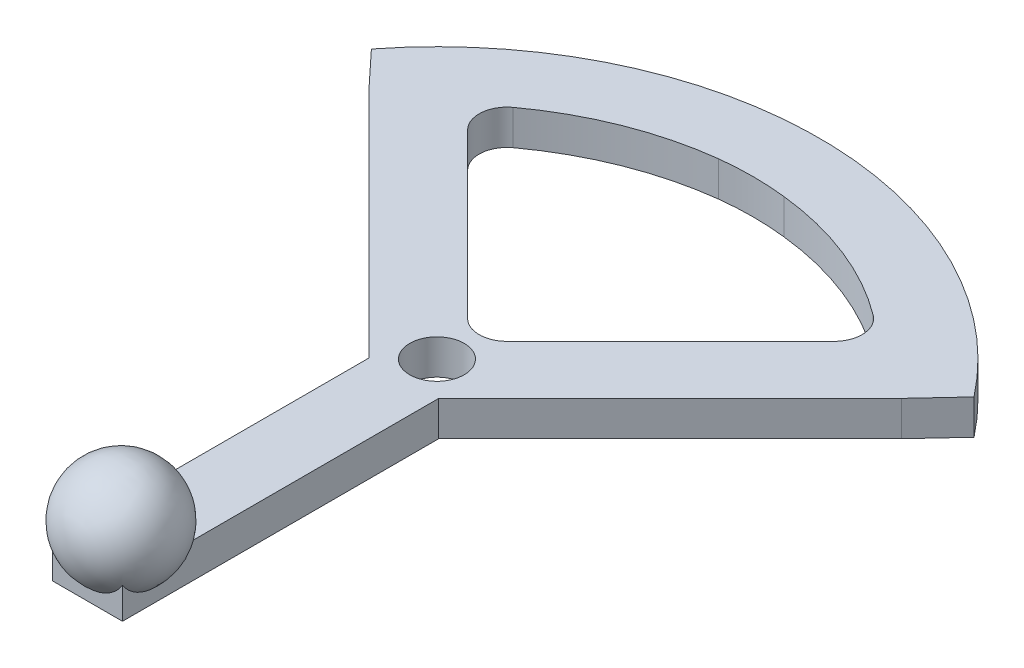
ISO-10303-21;
HEADER;
FILE_DESCRIPTION(('STEP AP214'),'2;1');
FILE_NAME('part.step','',(''),(''),'','','');
FILE_SCHEMA(('AUTOMOTIVE_DESIGN { 1 0 10303 214 1 1 1 1 }'));
ENDSEC;
DATA;
#1=APPLICATION_CONTEXT('core data for automotive mechanical design processes');
#2=APPLICATION_PROTOCOL_DEFINITION('international standard','automotive_design',2000,#1);
#3=PRODUCT_CONTEXT('',#1,'mechanical');
#4=PRODUCT('Part','Part','',(#3));
#5=PRODUCT_RELATED_PRODUCT_CATEGORY('part','',(#4));
#6=PRODUCT_DEFINITION_FORMATION('','',#4);
#7=PRODUCT_DEFINITION_CONTEXT('part definition',#1,'design');
#8=PRODUCT_DEFINITION('design','',#6,#7);
#9=PRODUCT_DEFINITION_SHAPE('','',#8);
#10=(LENGTH_UNIT() NAMED_UNIT(*) SI_UNIT(.MILLI.,.METRE.));
#11=(NAMED_UNIT(*) PLANE_ANGLE_UNIT() SI_UNIT($,.RADIAN.));
#12=(NAMED_UNIT(*) SI_UNIT($,.STERADIAN.) SOLID_ANGLE_UNIT());
#13=UNCERTAINTY_MEASURE_WITH_UNIT(LENGTH_MEASURE(1.E-05),#10,'distance_accuracy_value','');
#14=(GEOMETRIC_REPRESENTATION_CONTEXT(3) GLOBAL_UNCERTAINTY_ASSIGNED_CONTEXT((#13)) GLOBAL_UNIT_ASSIGNED_CONTEXT((#10,
#11,#12)) REPRESENTATION_CONTEXT('',''));
#15=CARTESIAN_POINT('',(0.,0.,0.));
#16=DIRECTION('',(0.,0.,1.));
#17=DIRECTION('',(1.,0.,0.));
#18=AXIS2_PLACEMENT_3D('',#15,#16,#17);
#19=CARTESIAN_POINT('',(-39.7785373265375,12.7,-45.3516658256481));
#20=DIRECTION('',(0.707106781186548,0.,-0.707106781186547));
#21=DIRECTION('',(-0.707106781186547,0.,-0.707106781186548));
#22=AXIS2_PLACEMENT_3D('',#19,#20,#21);
#23=PLANE('',#22);
#24=DIRECTION('',(0.707106781186547,0.,0.707106781186548));
#25=VECTOR('',#24,1.);
#26=CARTESIAN_POINT('',(-39.7785373265375,6.35,-45.3516658256481));
#27=LINE('',#26,#25);
#28=CARTESIAN_POINT('',(-33.2831311678834,6.35,-38.856259666994));
#29=VERTEX_POINT('',#28);
#30=CARTESIAN_POINT('',(-3.59210244842767,6.35,-9.16523094753825));
#31=VERTEX_POINT('',#30);
#32=EDGE_CURVE('E71',#29,#31,#27,.T.);
#33=ORIENTED_EDGE('',*,*,#32,.F.);
#34=DIRECTION('',(0.,-1.,0.));
#35=VECTOR('',#34,1.);
#36=CARTESIAN_POINT('',(-33.2831311678833,90.455148343755,-38.8562596669941));
#37=LINE('',#36,#35);
#38=CARTESIAN_POINT('',(-33.2831311678834,12.7,-38.856259666994));
#39=VERTEX_POINT('',#38);
#40=EDGE_CURVE('E66',#39,#29,#37,.T.);
#41=ORIENTED_EDGE('',*,*,#40,.F.);
#42=DIRECTION('',(0.707106781186547,0.,0.707106781186548));
#43=VECTOR('',#42,1.);
#44=CARTESIAN_POINT('',(-39.7785373265375,12.7,-45.3516658256481));
#45=LINE('',#44,#43);
#46=CARTESIAN_POINT('',(-3.59210244842767,12.7,-9.16523094753825));
#47=VERTEX_POINT('',#46);
#48=EDGE_CURVE('E271',#39,#47,#45,.T.);
#49=ORIENTED_EDGE('',*,*,#48,.T.);
#50=DIRECTION('',(0.,-1.,0.));
#51=VECTOR('',#50,1.);
#52=CARTESIAN_POINT('',(-3.59210244842766,0.,-9.16523094753824));
#53=LINE('',#52,#51);
#54=EDGE_CURVE('E684',#47,#31,#53,.T.);
#55=ORIENTED_EDGE('',*,*,#54,.T.);
#56=EDGE_LOOP('',(#33,#41,#49,#55));
#57=FACE_BOUND('',#56,.T.);
#58=ADVANCED_FACE('F51',(#57),#23,.T.);
#59=CARTESIAN_POINT('',(0.,12.7,0.));
#60=DIRECTION('',(0.,1.,0.));
#61=DIRECTION('',(0.,0.,1.));
#62=AXIS2_PLACEMENT_3D('',#59,#60,#61);
#63=PLANE('',#62);
#64=ORIENTED_EDGE('',*,*,#48,.F.);
#65=CARTESIAN_POINT('',(-29.6910287194557,12.7,-42.4483621154218));
#66=DIRECTION('',(0.,1.,0.));
#67=DIRECTION('',(0.,0.,1.));
#68=AXIS2_PLACEMENT_3D('',#65,#66,#67);
#69=CIRCLE('',#68,5.08);
#70=CARTESIAN_POINT('',(-32.692631835589,12.7,-46.5467494486565));
#71=VERTEX_POINT('',#70);
#72=EDGE_CURVE('E191',#71,#39,#69,.T.);
#73=ORIENTED_EDGE('',*,*,#72,.F.);
#74=CARTESIAN_POINT('',(0.887803026152101,12.7,-0.696041158092707));
#75=DIRECTION('',(0.,1.,0.));
#76=DIRECTION('',(0.,0.,1.));
#77=AXIS2_PLACEMENT_3D('',#74,#75,#76);
#78=CIRCLE('',#77,56.8325000000001);
#79=CARTESIAN_POINT('',(-5.94025595338294,12.7,-57.1168765544425));
#80=VERTEX_POINT('',#79);
#81=EDGE_CURVE('E178',#71,#80,#78,.F.);
#82=ORIENTED_EDGE('',*,*,#81,.T.);
#83=CARTESIAN_POINT('',(0.,12.7,-5.57312849911058));
#84=DIRECTION('',(0.,1.,0.));
#85=DIRECTION('',(0.,0.,1.));
#86=AXIS2_PLACEMENT_3D('',#83,#84,#85);
#87=CIRCLE('',#86,51.8849169256658);
#88=CARTESIAN_POINT('',(5.95896544452985,12.7,-57.1147169031764));
#89=VERTEX_POINT('',#88);
#90=EDGE_CURVE('E200',#80,#89,#87,.F.);
#91=ORIENTED_EDGE('',*,*,#90,.T.);
#92=CARTESIAN_POINT('',(0.,12.7,-2.81200490658602));
#93=DIRECTION('',(0.,1.,0.));
#94=DIRECTION('',(0.,0.,1.));
#95=AXIS2_PLACEMENT_3D('',#92,#93,#94);
#96=CIRCLE('',#95,54.6286902584507);
#97=CARTESIAN_POINT('',(32.7547865262767,12.7,-46.5317688466142));
#98=VERTEX_POINT('',#97);
#99=EDGE_CURVE('E195',#89,#98,#96,.F.);
#100=ORIENTED_EDGE('',*,*,#99,.T.);
#101=CARTESIAN_POINT('',(29.708872103539,12.7,-42.4662054995049));
#102=DIRECTION('',(0.,1.,0.));
#103=DIRECTION('',(0.,0.,1.));
#104=AXIS2_PLACEMENT_3D('',#101,#102,#103);
#105=CIRCLE('',#104,5.07999999999999);
#106=CARTESIAN_POINT('',(33.3009745519667,12.7,-38.8741030510773));
#107=VERTEX_POINT('',#106);
#108=EDGE_CURVE('E207',#107,#98,#105,.T.);
#109=ORIENTED_EDGE('',*,*,#108,.F.);
#110=DIRECTION('',(0.707106781186548,0.,-0.707106781186547));
#111=VECTOR('',#110,1.);
#112=CARTESIAN_POINT('',(0.,12.7,-5.57312849911058));
#113=LINE('',#112,#111);
#114=CARTESIAN_POINT('',(3.59210244842766,12.7,-9.16523094753824));
#115=VERTEX_POINT('',#114);
#116=EDGE_CURVE('E273',#115,#107,#113,.T.);
#117=ORIENTED_EDGE('',*,*,#116,.F.);
#118=CARTESIAN_POINT('',(0.,12.7,-12.7573333959659));
#119=DIRECTION('',(0.,1.,0.));
#120=DIRECTION('',(0.,0.,1.));
#121=AXIS2_PLACEMENT_3D('',#118,#119,#120);
#122=CIRCLE('',#121,5.08);
#123=EDGE_CURVE('E59',#115,#47,#122,.F.);
#124=ORIENTED_EDGE('',*,*,#123,.T.);
#125=EDGE_LOOP('',(#64,#73,#82,#91,#100,#109,#117,#124));
#126=FACE_BOUND('',#125,.T.);
#127=CARTESIAN_POINT('',(0.,12.7,0.));
#128=DIRECTION('',(0.,1.,0.));
#129=DIRECTION('',(0.,0.,1.));
#130=AXIS2_PLACEMENT_3D('',#127,#128,#129);
#131=CIRCLE('',#130,4.953);
#132=CARTESIAN_POINT('',(0.,12.7,4.953));
#133=VERTEX_POINT('',#132);
#134=EDGE_CURVE('E268',#133,#133,#131,.T.);
#135=ORIENTED_EDGE('',*,*,#134,.F.);
#136=EDGE_LOOP('',(#135));
#137=FACE_BOUND('',#136,.T.);
#138=DIRECTION('',(0.681998360062498,0.,-0.731353701619171));
#139=VECTOR('',#138,1.);
#140=CARTESIAN_POINT('',(49.4171515154173,12.7,-37.1184070236845));
#141=LINE('',#140,#139);
#142=CARTESIAN_POINT('',(48.391694320571,12.7,-36.0187388144617));
#143=VERTEX_POINT('',#142);
#144=CARTESIAN_POINT('',(54.7608316819994,12.7,-42.8488024307067));
#145=VERTEX_POINT('',#144);
#146=EDGE_CURVE('E290',#143,#145,#141,.T.);
#147=ORIENTED_EDGE('',*,*,#146,.T.);
#148=CARTESIAN_POINT('',(0.,12.7,0.));
#149=DIRECTION('',(0.,1.,0.));
#150=DIRECTION('',(0.,0.,1.));
#151=AXIS2_PLACEMENT_3D('',#148,#149,#150);
#152=CIRCLE('',#151,69.5325);
#153=CARTESIAN_POINT('',(-54.7608316819994,12.7,-42.8488024307067));
#154=VERTEX_POINT('',#153);
#155=EDGE_CURVE('E225',#145,#154,#152,.T.);
#156=ORIENTED_EDGE('',*,*,#155,.T.);
#157=DIRECTION('',(0.681998360062498,0.,0.731353701619171));
#158=VECTOR('',#157,1.);
#159=CARTESIAN_POINT('',(-56.4189854668726,12.7,-44.6269546660137));
#160=LINE('',#159,#158);
#161=CARTESIAN_POINT('',(-48.391694320571,12.7,-36.0187388144618));
#162=VERTEX_POINT('',#161);
#163=EDGE_CURVE('E291',#154,#162,#160,.T.);
#164=ORIENTED_EDGE('',*,*,#163,.T.);
#165=DIRECTION('',(-0.707106781186547,0.,-0.707106781186548));
#166=VECTOR('',#165,1.);
#167=CARTESIAN_POINT('',(-48.391694320571,12.7,-36.0187388144618));
#168=LINE('',#167,#166);
#169=CARTESIAN_POINT('',(-6.34999999999972,12.7,6.02295550610956));
#170=VERTEX_POINT('',#169);
#171=EDGE_CURVE('E278',#170,#162,#168,.T.);
#172=ORIENTED_EDGE('',*,*,#171,.F.);
#173=DIRECTION('',(0.,0.,-1.));
#174=VECTOR('',#173,1.);
#175=CARTESIAN_POINT('',(-6.34999999999971,12.7,4.87647737193525));
#176=LINE('',#175,#174);
#177=CARTESIAN_POINT('',(-6.34999999999971,12.7,50.9544231423557));
#178=VERTEX_POINT('',#177);
#179=EDGE_CURVE('E284',#178,#170,#176,.T.);
#180=ORIENTED_EDGE('',*,*,#179,.F.);
#181=CARTESIAN_POINT('',(0.,12.7,57.4301779246189));
#182=DIRECTION('',(0.,1.,0.));
#183=DIRECTION('',(0.,0.,1.));
#184=AXIS2_PLACEMENT_3D('',#181,#182,#183);
#185=CIRCLE('',#184,9.06961410424942);
#186=CARTESIAN_POINT('',(6.35000000000029,12.7,50.9544231423563));
#187=VERTEX_POINT('',#186);
#188=EDGE_CURVE('E235',#187,#178,#185,.T.);
#189=ORIENTED_EDGE('',*,*,#188,.F.);
#190=DIRECTION('',(0.,0.,1.));
#191=VECTOR('',#190,1.);
#192=CARTESIAN_POINT('',(6.35000000000029,12.7,4.87647737193525));
#193=LINE('',#192,#191);
#194=CARTESIAN_POINT('',(6.35000000000029,12.7,6.022955506109));
#195=VERTEX_POINT('',#194);
#196=EDGE_CURVE('E287',#195,#187,#193,.T.);
#197=ORIENTED_EDGE('',*,*,#196,.F.);
#198=DIRECTION('',(-0.707106781186548,0.,0.707106781186547));
#199=VECTOR('',#198,1.);
#200=CARTESIAN_POINT('',(0.,12.7,12.3729555061093));
#201=LINE('',#200,#199);
#202=EDGE_CURVE('E275',#143,#195,#201,.T.);
#203=ORIENTED_EDGE('',*,*,#202,.F.);
#204=EDGE_LOOP('',(#147,#156,#164,#172,#180,#189,#197,#203));
#205=FACE_BOUND('',#204,.T.);
#206=ADVANCED_FACE('F692',(#126,#137,#205),#63,.T.);
#207=CARTESIAN_POINT('',(48.391694320571,0.,-36.0187388144617));
#208=DIRECTION('',(0.731353701619171,0.,0.681998360062498));
#209=DIRECTION('',(0.681998360062498,0.,-0.731353701619171));
#210=AXIS2_PLACEMENT_3D('',#207,#208,#209);
#211=PLANE('',#210);
#212=DIRECTION('',(-0.681998360062498,0.,0.731353701619171));
#213=VECTOR('',#212,1.);
#214=CARTESIAN_POINT('',(48.391694320571,6.35,-36.0187388144617));
#215=LINE('',#214,#213);
#216=CARTESIAN_POINT('',(54.7608316819994,6.35,-42.8488024307067));
#217=VERTEX_POINT('',#216);
#218=CARTESIAN_POINT('',(48.391694320571,6.35,-36.0187388144617));
#219=VERTEX_POINT('',#218);
#220=EDGE_CURVE('E251',#217,#219,#215,.T.);
#221=ORIENTED_EDGE('',*,*,#220,.F.);
#222=DIRECTION('',(0.,-1.,0.));
#223=VECTOR('',#222,1.);
#224=CARTESIAN_POINT('',(54.7608316819994,25.654,-42.8488024307067));
#225=LINE('',#224,#223);
#226=EDGE_CURVE('E223',#145,#217,#225,.T.);
#227=ORIENTED_EDGE('',*,*,#226,.F.);
#228=ORIENTED_EDGE('',*,*,#146,.F.);
#229=DIRECTION('',(0.,1.,0.));
#230=VECTOR('',#229,1.);
#231=CARTESIAN_POINT('',(48.391694320571,0.,-36.0187388144617));
#232=LINE('',#231,#230);
#233=EDGE_CURVE('E295',#219,#143,#232,.T.);
#234=ORIENTED_EDGE('',*,*,#233,.F.);
#235=EDGE_LOOP('',(#221,#227,#228,#234));
#236=FACE_BOUND('',#235,.T.);
#237=ADVANCED_FACE('F702',(#236),#211,.T.);
#238=CARTESIAN_POINT('',(-57.1706898676213,0.,-45.4330589445645));
#239=DIRECTION('',(-0.731353701619171,0.,0.681998360062498));
#240=DIRECTION('',(0.681998360062498,0.,0.731353701619171));
#241=AXIS2_PLACEMENT_3D('',#238,#239,#240);
#242=PLANE('',#241);
#243=ORIENTED_EDGE('',*,*,#163,.F.);
#244=DIRECTION('',(0.,-1.,0.));
#245=VECTOR('',#244,1.);
#246=CARTESIAN_POINT('',(-54.7608316819994,25.654,-42.8488024307067));
#247=LINE('',#246,#245);
#248=CARTESIAN_POINT('',(-54.7608316819994,6.35,-42.8488024307067));
#249=VERTEX_POINT('',#248);
#250=EDGE_CURVE('E222',#154,#249,#247,.T.);
#251=ORIENTED_EDGE('',*,*,#250,.T.);
#252=DIRECTION('',(-0.681998360062498,0.,-0.731353701619171));
#253=VECTOR('',#252,1.);
#254=CARTESIAN_POINT('',(-57.1706898676213,6.35,-45.4330589445645));
#255=LINE('',#254,#253);
#256=CARTESIAN_POINT('',(-48.391694320571,6.35,-36.0187388144618));
#257=VERTEX_POINT('',#256);
#258=EDGE_CURVE('E265',#257,#249,#255,.T.);
#259=ORIENTED_EDGE('',*,*,#258,.F.);
#260=DIRECTION('',(0.,1.,0.));
#261=VECTOR('',#260,1.);
#262=CARTESIAN_POINT('',(-48.391694320571,0.,-36.0187388144618));
#263=LINE('',#262,#261);
#264=EDGE_CURVE('E406',#257,#162,#263,.T.);
#265=ORIENTED_EDGE('',*,*,#264,.T.);
#266=EDGE_LOOP('',(#243,#251,#259,#265));
#267=FACE_BOUND('',#266,.T.);
#268=ADVANCED_FACE('F722',(#267),#242,.T.);
#269=CARTESIAN_POINT('',(0.,6.35,0.));
#270=DIRECTION('',(0.,1.,0.));
#271=DIRECTION('',(0.,0.,1.));
#272=AXIS2_PLACEMENT_3D('',#269,#270,#271);
#273=PLANE('',#272);
#274=CARTESIAN_POINT('',(-29.6910287194557,6.35,-42.4483621154218));
#275=DIRECTION('',(0.,1.,0.));
#276=DIRECTION('',(0.,0.,1.));
#277=AXIS2_PLACEMENT_3D('',#274,#275,#276);
#278=CIRCLE('',#277,5.08);
#279=CARTESIAN_POINT('',(-32.692631835589,6.35,-46.5467494486565));
#280=VERTEX_POINT('',#279);
#281=EDGE_CURVE('E188',#280,#29,#278,.T.);
#282=ORIENTED_EDGE('',*,*,#281,.T.);
#283=ORIENTED_EDGE('',*,*,#32,.T.);
#284=CARTESIAN_POINT('',(0.,6.35,-12.7573333959659));
#285=DIRECTION('',(0.,1.,0.));
#286=DIRECTION('',(0.,0.,1.));
#287=AXIS2_PLACEMENT_3D('',#284,#285,#286);
#288=CIRCLE('',#287,5.08);
#289=CARTESIAN_POINT('',(3.59210244842766,6.35,-9.16523094753823));
#290=VERTEX_POINT('',#289);
#291=EDGE_CURVE('E239',#290,#31,#288,.F.);
#292=ORIENTED_EDGE('',*,*,#291,.F.);
#293=DIRECTION('',(0.707106781186548,0.,-0.707106781186547));
#294=VECTOR('',#293,1.);
#295=CARTESIAN_POINT('',(0.,6.35,-5.57312849911058));
#296=LINE('',#295,#294);
#297=CARTESIAN_POINT('',(33.3009745519667,6.35,-38.8741030510773));
#298=VERTEX_POINT('',#297);
#299=EDGE_CURVE('E242',#290,#298,#296,.T.);
#300=ORIENTED_EDGE('',*,*,#299,.T.);
#301=CARTESIAN_POINT('',(29.708872103539,6.35,-42.4662054995049));
#302=DIRECTION('',(0.,1.,0.));
#303=DIRECTION('',(0.,0.,1.));
#304=AXIS2_PLACEMENT_3D('',#301,#302,#303);
#305=CIRCLE('',#304,5.07999999999999);
#306=CARTESIAN_POINT('',(32.7547865262767,6.35,-46.5317688466142));
#307=VERTEX_POINT('',#306);
#308=EDGE_CURVE('E194',#298,#307,#305,.T.);
#309=ORIENTED_EDGE('',*,*,#308,.T.);
#310=CARTESIAN_POINT('',(0.,6.35,-2.81200490658602));
#311=DIRECTION('',(0.,-1.,0.));
#312=DIRECTION('',(0.,0.,-1.));
#313=AXIS2_PLACEMENT_3D('',#310,#311,#312);
#314=CIRCLE('',#313,54.6286902584507);
#315=CARTESIAN_POINT('',(5.95896544452985,6.35,-57.1147169031765));
#316=VERTEX_POINT('',#315);
#317=EDGE_CURVE('E213',#316,#307,#314,.T.);
#318=ORIENTED_EDGE('',*,*,#317,.F.);
#319=CARTESIAN_POINT('',(0.,6.35,-5.57312849911058));
#320=DIRECTION('',(0.,-1.,0.));
#321=DIRECTION('',(0.,0.,-1.));
#322=AXIS2_PLACEMENT_3D('',#319,#320,#321);
#323=CIRCLE('',#322,51.8849169256658);
#324=CARTESIAN_POINT('',(-5.94025595338294,6.35,-57.1168765544425));
#325=VERTEX_POINT('',#324);
#326=EDGE_CURVE('E182',#325,#316,#323,.T.);
#327=ORIENTED_EDGE('',*,*,#326,.F.);
#328=CARTESIAN_POINT('',(0.887803026152101,6.35,-0.696041158092707));
#329=DIRECTION('',(0.,-1.,0.));
#330=DIRECTION('',(0.,0.,-1.));
#331=AXIS2_PLACEMENT_3D('',#328,#329,#330);
#332=CIRCLE('',#331,56.8325000000001);
#333=EDGE_CURVE('E176',#280,#325,#332,.T.);
#334=ORIENTED_EDGE('',*,*,#333,.F.);
#335=EDGE_LOOP('',(#282,#283,#292,#300,#309,#318,#327,#334));
#336=FACE_BOUND('',#335,.T.);
#337=CARTESIAN_POINT('',(0.,6.35,0.));
#338=DIRECTION('',(0.,1.,0.));
#339=DIRECTION('',(0.,0.,1.));
#340=AXIS2_PLACEMENT_3D('',#337,#338,#339);
#341=CIRCLE('',#340,4.953);
#342=CARTESIAN_POINT('',(0.,6.35,4.953));
#343=VERTEX_POINT('',#342);
#344=EDGE_CURVE('E245',#343,#343,#341,.F.);
#345=ORIENTED_EDGE('',*,*,#344,.F.);
#346=EDGE_LOOP('',(#345));
#347=FACE_BOUND('',#346,.T.);
#348=CARTESIAN_POINT('',(0.,6.35,57.4301779246189));
#349=VERTEX_POINT('',#348);
#350=VERTEX_LOOP('',#349);
#351=FACE_BOUND('',#350,.T.);
#352=CARTESIAN_POINT('',(0.,6.35,0.));
#353=DIRECTION('',(0.,-1.,0.));
#354=DIRECTION('',(0.,0.,-1.));
#355=AXIS2_PLACEMENT_3D('',#352,#353,#354);
#356=CIRCLE('',#355,69.5325);
#357=EDGE_CURVE('E219',#249,#217,#356,.T.);
#358=ORIENTED_EDGE('',*,*,#357,.T.);
#359=ORIENTED_EDGE('',*,*,#220,.T.);
#360=DIRECTION('',(-0.707106781186548,0.,0.707106781186547));
#361=VECTOR('',#360,1.);
#362=CARTESIAN_POINT('',(0.,6.35,12.3729555061093));
#363=LINE('',#362,#361);
#364=CARTESIAN_POINT('',(6.35000000000029,6.35,6.022955506109));
#365=VERTEX_POINT('',#364);
#366=EDGE_CURVE('E248',#219,#365,#363,.T.);
#367=ORIENTED_EDGE('',*,*,#366,.T.);
#368=DIRECTION('',(0.,0.,-1.));
#369=VECTOR('',#368,1.);
#370=CARTESIAN_POINT('',(6.35000000000029,6.35,4.87647737193525));
#371=LINE('',#370,#369);
#372=CARTESIAN_POINT('',(6.35000000000029,6.35,63.5));
#373=VERTEX_POINT('',#372);
#374=EDGE_CURVE('E253',#373,#365,#371,.T.);
#375=ORIENTED_EDGE('',*,*,#374,.F.);
#376=DIRECTION('',(-1.,0.,0.));
#377=VECTOR('',#376,1.);
#378=CARTESIAN_POINT('',(6.35000000000029,6.35,63.5));
#379=LINE('',#378,#377);
#380=CARTESIAN_POINT('',(-6.34999999999972,6.35,63.5));
#381=VERTEX_POINT('',#380);
#382=EDGE_CURVE('E256',#373,#381,#379,.T.);
#383=ORIENTED_EDGE('',*,*,#382,.T.);
#384=DIRECTION('',(0.,0.,1.));
#385=VECTOR('',#384,1.);
#386=CARTESIAN_POINT('',(-6.34999999999971,6.35,4.87647737193525));
#387=LINE('',#386,#385);
#388=CARTESIAN_POINT('',(-6.34999999999971,6.35,6.02295550610957));
#389=VERTEX_POINT('',#388);
#390=EDGE_CURVE('E259',#389,#381,#387,.T.);
#391=ORIENTED_EDGE('',*,*,#390,.F.);
#392=DIRECTION('',(-0.707106781186547,0.,-0.707106781186548));
#393=VECTOR('',#392,1.);
#394=CARTESIAN_POINT('',(-48.391694320571,6.35,-36.0187388144618));
#395=LINE('',#394,#393);
#396=EDGE_CURVE('E262',#389,#257,#395,.T.);
#397=ORIENTED_EDGE('',*,*,#396,.T.);
#398=ORIENTED_EDGE('',*,*,#258,.T.);
#399=EDGE_LOOP('',(#358,#359,#367,#375,#383,#391,#397,#398));
#400=FACE_BOUND('',#399,.T.);
#401=ADVANCED_FACE('F186',(#336,#347,#351,#400),#273,.F.);
#402=CARTESIAN_POINT('',(0.,16.002,57.4301779246189));
#403=DIRECTION('',(0.,0.,-1.));
#404=DIRECTION('',(-1.,0.,0.));
#405=AXIS2_PLACEMENT_3D('',#402,#403,#404);
#406=SPHERICAL_SURFACE('',#405,9.652);
#407=CARTESIAN_POINT('',(6.35000000000029,16.002,57.4301779246189));
#408=DIRECTION('',(-1.,0.,0.));
#409=DIRECTION('',(0.,0.,1.));
#410=AXIS2_PLACEMENT_3D('',#407,#408,#409);
#411=CIRCLE('',#410,7.26901671479687);
#412=CARTESIAN_POINT('',(6.35000000000029,12.0025170367644,63.5));
#413=VERTEX_POINT('',#412);
#414=EDGE_CURVE('E232',#187,#413,#411,.T.);
#415=ORIENTED_EDGE('',*,*,#414,.F.);
#416=ORIENTED_EDGE('',*,*,#188,.T.);
#417=CARTESIAN_POINT('',(-6.3499999999997,16.002,57.4301779246189));
#418=DIRECTION('',(1.,0.,0.));
#419=DIRECTION('',(0.,0.,-1.));
#420=AXIS2_PLACEMENT_3D('',#417,#418,#419);
#421=CIRCLE('',#420,7.26901671479738);
#422=CARTESIAN_POINT('',(-6.34999999999972,12.0025170367635,63.5));
#423=VERTEX_POINT('',#422);
#424=EDGE_CURVE('E230',#423,#178,#421,.T.);
#425=ORIENTED_EDGE('',*,*,#424,.F.);
#426=CARTESIAN_POINT('',(0.,16.002,63.5));
#427=DIRECTION('',(0.,0.,1.));
#428=DIRECTION('',(1.,0.,0.));
#429=AXIS2_PLACEMENT_3D('',#426,#427,#428);
#430=CIRCLE('',#429,7.50455621427515);
#431=EDGE_CURVE('E14',#423,#413,#430,.T.);
#432=ORIENTED_EDGE('',*,*,#431,.T.);
#433=EDGE_LOOP('',(#415,#416,#425,#432));
#434=FACE_BOUND('',#433,.T.);
#435=ADVANCED_FACE('F719',(#434),#406,.T.);
#436=CARTESIAN_POINT('',(6.35000000000029,0.,4.87647737193525));
#437=DIRECTION('',(-1.,0.,0.));
#438=DIRECTION('',(0.,0.,1.));
#439=AXIS2_PLACEMENT_3D('',#436,#437,#438);
#440=PLANE('',#439);
#441=ORIENTED_EDGE('',*,*,#196,.T.);
#442=ORIENTED_EDGE('',*,*,#414,.T.);
#443=DIRECTION('',(0.,-1.,0.));
#444=VECTOR('',#443,1.);
#445=CARTESIAN_POINT('',(6.35000000000029,12.7,63.5));
#446=LINE('',#445,#444);
#447=EDGE_CURVE('E281',#413,#373,#446,.T.);
#448=ORIENTED_EDGE('',*,*,#447,.T.);
#449=ORIENTED_EDGE('',*,*,#374,.T.);
#450=DIRECTION('',(0.,1.,0.));
#451=VECTOR('',#450,1.);
#452=CARTESIAN_POINT('',(6.35000000000029,0.,6.022955506109));
#453=LINE('',#452,#451);
#454=EDGE_CURVE('E682',#365,#195,#453,.T.);
#455=ORIENTED_EDGE('',*,*,#454,.T.);
#456=EDGE_LOOP('',(#441,#442,#448,#449,#455));
#457=FACE_BOUND('',#456,.T.);
#458=ADVANCED_FACE('F716',(#457),#440,.F.);
#459=CARTESIAN_POINT('',(-6.34999999999971,0.,4.87647737193525));
#460=DIRECTION('',(1.,0.,0.));
#461=DIRECTION('',(0.,0.,-1.));
#462=AXIS2_PLACEMENT_3D('',#459,#460,#461);
#463=PLANE('',#462);
#464=DIRECTION('',(0.,-1.,0.));
#465=VECTOR('',#464,1.);
#466=CARTESIAN_POINT('',(-6.34999999999972,12.7,63.5));
#467=LINE('',#466,#465);
#468=EDGE_CURVE('E282',#423,#381,#467,.T.);
#469=ORIENTED_EDGE('',*,*,#468,.F.);
#470=ORIENTED_EDGE('',*,*,#424,.T.);
#471=ORIENTED_EDGE('',*,*,#179,.T.);
#472=DIRECTION('',(0.,-1.,0.));
#473=VECTOR('',#472,1.);
#474=CARTESIAN_POINT('',(-6.34999999999971,0.,6.02295550610957));
#475=LINE('',#474,#473);
#476=EDGE_CURVE('E677',#170,#389,#475,.T.);
#477=ORIENTED_EDGE('',*,*,#476,.T.);
#478=ORIENTED_EDGE('',*,*,#390,.T.);
#479=EDGE_LOOP('',(#469,#470,#471,#477,#478));
#480=FACE_BOUND('',#479,.T.);
#481=ADVANCED_FACE('F712',(#480),#463,.F.);
#482=CARTESIAN_POINT('',(6.35000000000029,12.7,63.5));
#483=DIRECTION('',(0.,0.,1.));
#484=DIRECTION('',(1.,0.,0.));
#485=AXIS2_PLACEMENT_3D('',#482,#483,#484);
#486=PLANE('',#485);
#487=ORIENTED_EDGE('',*,*,#431,.F.);
#488=ORIENTED_EDGE('',*,*,#468,.T.);
#489=ORIENTED_EDGE('',*,*,#382,.F.);
#490=ORIENTED_EDGE('',*,*,#447,.F.);
#491=EDGE_LOOP('',(#487,#488,#489,#490));
#492=FACE_BOUND('',#491,.T.);
#493=ADVANCED_FACE('F708',(#492),#486,.T.);
#494=CARTESIAN_POINT('',(-48.391694320571,12.7,-36.0187388144618));
#495=DIRECTION('',(-0.707106781186548,0.,0.707106781186547));
#496=DIRECTION('',(0.707106781186547,0.,0.707106781186548));
#497=AXIS2_PLACEMENT_3D('',#494,#495,#496);
#498=PLANE('',#497);
#499=ORIENTED_EDGE('',*,*,#396,.F.);
#500=ORIENTED_EDGE('',*,*,#476,.F.);
#501=ORIENTED_EDGE('',*,*,#171,.T.);
#502=ORIENTED_EDGE('',*,*,#264,.F.);
#503=EDGE_LOOP('',(#499,#500,#501,#502));
#504=FACE_BOUND('',#503,.T.);
#505=ADVANCED_FACE('F711',(#504),#498,.T.);
#506=CARTESIAN_POINT('',(0.,12.7,12.3729555061093));
#507=DIRECTION('',(0.707106781186547,0.,0.707106781186548));
#508=DIRECTION('',(0.707106781186548,0.,-0.707106781186547));
#509=AXIS2_PLACEMENT_3D('',#506,#507,#508);
#510=PLANE('',#509);
#511=ORIENTED_EDGE('',*,*,#366,.F.);
#512=ORIENTED_EDGE('',*,*,#233,.T.);
#513=ORIENTED_EDGE('',*,*,#202,.T.);
#514=ORIENTED_EDGE('',*,*,#454,.F.);
#515=EDGE_LOOP('',(#511,#512,#513,#514));
#516=FACE_BOUND('',#515,.T.);
#517=ADVANCED_FACE('F738',(#516),#510,.T.);
#518=CARTESIAN_POINT('',(0.,12.7,-5.57312849911058));
#519=DIRECTION('',(-0.707106781186547,0.,-0.707106781186548));
#520=DIRECTION('',(-0.707106781186548,0.,0.707106781186547));
#521=AXIS2_PLACEMENT_3D('',#518,#519,#520);
#522=PLANE('',#521);
#523=DIRECTION('',(0.,-1.,0.));
#524=VECTOR('',#523,1.);
#525=CARTESIAN_POINT('',(33.3009745519667,90.455148343755,-38.8741030510773));
#526=LINE('',#525,#524);
#527=EDGE_CURVE('E198',#107,#298,#526,.T.);
#528=ORIENTED_EDGE('',*,*,#527,.T.);
#529=ORIENTED_EDGE('',*,*,#299,.F.);
#530=DIRECTION('',(0.,-1.,0.));
#531=VECTOR('',#530,1.);
#532=CARTESIAN_POINT('',(3.59210244842766,12.7,-9.16523094753824));
#533=LINE('',#532,#531);
#534=EDGE_CURVE('E686',#290,#115,#533,.F.);
#535=ORIENTED_EDGE('',*,*,#534,.T.);
#536=ORIENTED_EDGE('',*,*,#116,.T.);
#537=EDGE_LOOP('',(#528,#529,#535,#536));
#538=FACE_BOUND('',#537,.T.);
#539=ADVANCED_FACE('F706',(#538),#522,.T.);
#540=CARTESIAN_POINT('',(0.,0.,0.));
#541=DIRECTION('',(0.,1.,0.));
#542=DIRECTION('',(0.,0.,1.));
#543=AXIS2_PLACEMENT_3D('',#540,#541,#542);
#544=CYLINDRICAL_SURFACE('',#543,4.953);
#545=ORIENTED_EDGE('',*,*,#344,.T.);
#546=EDGE_LOOP('',(#545));
#547=FACE_BOUND('',#546,.T.);
#548=ORIENTED_EDGE('',*,*,#134,.T.);
#549=EDGE_LOOP('',(#548));
#550=FACE_BOUND('',#549,.T.);
#551=ADVANCED_FACE('F764',(#547,#550),#544,.F.);
#552=CARTESIAN_POINT('',(0.,12.7,-12.7573333959659));
#553=DIRECTION('',(0.,1.,0.));
#554=DIRECTION('',(0.,0.,1.));
#555=AXIS2_PLACEMENT_3D('',#552,#553,#554);
#556=CYLINDRICAL_SURFACE('',#555,5.08);
#557=ORIENTED_EDGE('',*,*,#534,.F.);
#558=ORIENTED_EDGE('',*,*,#291,.T.);
#559=ORIENTED_EDGE('',*,*,#54,.F.);
#560=ORIENTED_EDGE('',*,*,#123,.F.);
#561=EDGE_LOOP('',(#557,#558,#559,#560));
#562=FACE_BOUND('',#561,.T.);
#563=ADVANCED_FACE('F53',(#562),#556,.F.);
#564=CARTESIAN_POINT('',(0.,25.654,0.));
#565=DIRECTION('',(0.,-1.,0.));
#566=DIRECTION('',(0.,0.,-1.));
#567=AXIS2_PLACEMENT_3D('',#564,#565,#566);
#568=CYLINDRICAL_SURFACE('',#567,69.5325);
#569=ORIENTED_EDGE('',*,*,#226,.T.);
#570=ORIENTED_EDGE('',*,*,#357,.F.);
#571=ORIENTED_EDGE('',*,*,#250,.F.);
#572=ORIENTED_EDGE('',*,*,#155,.F.);
#573=EDGE_LOOP('',(#569,#570,#571,#572));
#574=FACE_BOUND('',#573,.T.);
#575=ADVANCED_FACE('F753',(#574),#568,.T.);
#576=CARTESIAN_POINT('',(29.708872103539,90.455148343755,-42.4662054995049));
#577=DIRECTION('',(0.,-1.,0.));
#578=DIRECTION('',(0.,0.,-1.));
#579=AXIS2_PLACEMENT_3D('',#576,#577,#578);
#580=CYLINDRICAL_SURFACE('',#579,5.07999999999999);
#581=ORIENTED_EDGE('',*,*,#527,.F.);
#582=ORIENTED_EDGE('',*,*,#108,.T.);
#583=DIRECTION('',(0.,-1.,0.));
#584=VECTOR('',#583,1.);
#585=CARTESIAN_POINT('',(32.7547865262767,90.455148343755,-46.5317688466142));
#586=LINE('',#585,#584);
#587=EDGE_CURVE('E209',#98,#307,#586,.T.);
#588=ORIENTED_EDGE('',*,*,#587,.T.);
#589=ORIENTED_EDGE('',*,*,#308,.F.);
#590=EDGE_LOOP('',(#581,#582,#588,#589));
#591=FACE_BOUND('',#590,.T.);
#592=ADVANCED_FACE('F755',(#591),#580,.F.);
#593=CARTESIAN_POINT('',(0.,90.455148343755,-2.81200490658602));
#594=DIRECTION('',(0.,-1.,0.));
#595=DIRECTION('',(0.,0.,-1.));
#596=AXIS2_PLACEMENT_3D('',#593,#594,#595);
#597=CYLINDRICAL_SURFACE('',#596,54.6286902584507);
#598=ORIENTED_EDGE('',*,*,#99,.F.);
#599=DIRECTION('',(0.,-1.,0.));
#600=VECTOR('',#599,1.);
#601=CARTESIAN_POINT('',(5.95896544452985,90.455148343755,-57.1147169031765));
#602=LINE('',#601,#600);
#603=EDGE_CURVE('E214',#89,#316,#602,.T.);
#604=ORIENTED_EDGE('',*,*,#603,.T.);
#605=ORIENTED_EDGE('',*,*,#317,.T.);
#606=ORIENTED_EDGE('',*,*,#587,.F.);
#607=EDGE_LOOP('',(#598,#604,#605,#606));
#608=FACE_BOUND('',#607,.T.);
#609=ADVANCED_FACE('F761',(#608),#597,.F.);
#610=CARTESIAN_POINT('',(0.,90.455148343755,-5.57312849911058));
#611=DIRECTION('',(0.,-1.,0.));
#612=DIRECTION('',(0.,0.,-1.));
#613=AXIS2_PLACEMENT_3D('',#610,#611,#612);
#614=CYLINDRICAL_SURFACE('',#613,51.8849169256658);
#615=ORIENTED_EDGE('',*,*,#90,.F.);
#616=DIRECTION('',(0.,-1.,0.));
#617=VECTOR('',#616,1.);
#618=CARTESIAN_POINT('',(-5.94025595338294,90.455148343755,-57.1168765544425));
#619=LINE('',#618,#617);
#620=EDGE_CURVE('E211',#80,#325,#619,.T.);
#621=ORIENTED_EDGE('',*,*,#620,.T.);
#622=ORIENTED_EDGE('',*,*,#326,.T.);
#623=ORIENTED_EDGE('',*,*,#603,.F.);
#624=EDGE_LOOP('',(#615,#621,#622,#623));
#625=FACE_BOUND('',#624,.T.);
#626=ADVANCED_FACE('F794',(#625),#614,.F.);
#627=CARTESIAN_POINT('',(0.887803026152101,90.455148343755,-0.696041158092707));
#628=DIRECTION('',(0.,-1.,0.));
#629=DIRECTION('',(0.,0.,-1.));
#630=AXIS2_PLACEMENT_3D('',#627,#628,#629);
#631=CYLINDRICAL_SURFACE('',#630,56.8325000000001);
#632=ORIENTED_EDGE('',*,*,#81,.F.);
#633=DIRECTION('',(0.,-1.,0.));
#634=VECTOR('',#633,1.);
#635=CARTESIAN_POINT('',(-32.692631835589,90.455148343755,-46.5467494486565));
#636=LINE('',#635,#634);
#637=EDGE_CURVE('E172',#71,#280,#636,.T.);
#638=ORIENTED_EDGE('',*,*,#637,.T.);
#639=ORIENTED_EDGE('',*,*,#333,.T.);
#640=ORIENTED_EDGE('',*,*,#620,.F.);
#641=EDGE_LOOP('',(#632,#638,#639,#640));
#642=FACE_BOUND('',#641,.T.);
#643=ADVANCED_FACE('F174',(#642),#631,.F.);
#644=CARTESIAN_POINT('',(-29.6910287194557,90.455148343755,-42.4483621154218));
#645=DIRECTION('',(0.,-1.,0.));
#646=DIRECTION('',(0.,0.,-1.));
#647=AXIS2_PLACEMENT_3D('',#644,#645,#646);
#648=CYLINDRICAL_SURFACE('',#647,5.08);
#649=ORIENTED_EDGE('',*,*,#637,.F.);
#650=ORIENTED_EDGE('',*,*,#72,.T.);
#651=ORIENTED_EDGE('',*,*,#40,.T.);
#652=ORIENTED_EDGE('',*,*,#281,.F.);
#653=EDGE_LOOP('',(#649,#650,#651,#652));
#654=FACE_BOUND('',#653,.T.);
#655=ADVANCED_FACE('F193',(#654),#648,.F.);
#656=CLOSED_SHELL('',(#58,#206,#237,#268,#401,#435,#458,#481,#493,#505,#517,#539,#551,#563,#575,
#592,#609,#626,#643,#655));
#657=MANIFOLD_SOLID_BREP('B2',#656);
#658=ADVANCED_BREP_SHAPE_REPRESENTATION('',(#18,#657),#14);
#659=SHAPE_DEFINITION_REPRESENTATION(#9,#658);
ENDSEC;
END-ISO-10303-21;
